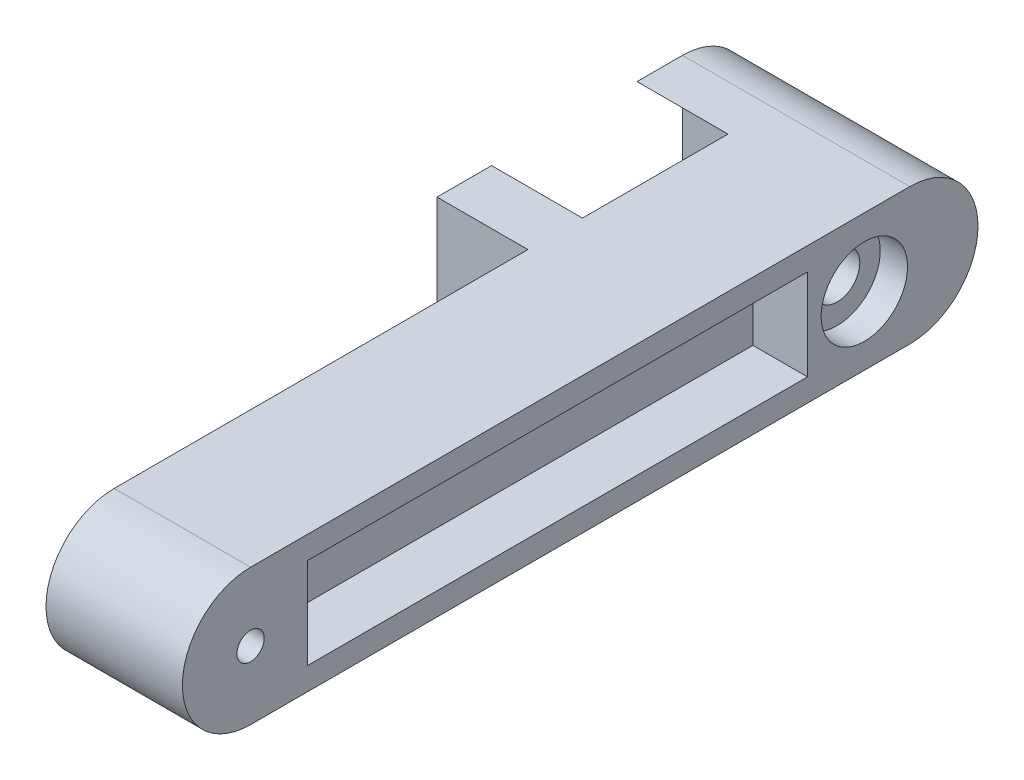
ISO-10303-21;
HEADER;
FILE_DESCRIPTION(('STEP AP214'),'2;1');
FILE_NAME('part.step','',(''),(''),'','','');
FILE_SCHEMA(('AUTOMOTIVE_DESIGN { 1 0 10303 214 1 1 1 1 }'));
ENDSEC;
DATA;
#1=APPLICATION_CONTEXT('core data for automotive mechanical design processes');
#2=APPLICATION_PROTOCOL_DEFINITION('international standard','automotive_design',2000,#1);
#3=PRODUCT_CONTEXT('',#1,'mechanical');
#4=PRODUCT('Part','Part','',(#3));
#5=PRODUCT_RELATED_PRODUCT_CATEGORY('part','',(#4));
#6=PRODUCT_DEFINITION_FORMATION('','',#4);
#7=PRODUCT_DEFINITION_CONTEXT('part definition',#1,'design');
#8=PRODUCT_DEFINITION('design','',#6,#7);
#9=PRODUCT_DEFINITION_SHAPE('','',#8);
#10=(LENGTH_UNIT() NAMED_UNIT(*) SI_UNIT(.MILLI.,.METRE.));
#11=(NAMED_UNIT(*) PLANE_ANGLE_UNIT() SI_UNIT($,.RADIAN.));
#12=(NAMED_UNIT(*) SI_UNIT($,.STERADIAN.) SOLID_ANGLE_UNIT());
#13=UNCERTAINTY_MEASURE_WITH_UNIT(LENGTH_MEASURE(1.E-05),#10,'distance_accuracy_value','');
#14=(GEOMETRIC_REPRESENTATION_CONTEXT(3) GLOBAL_UNCERTAINTY_ASSIGNED_CONTEXT((#13)) GLOBAL_UNIT_ASSIGNED_CONTEXT((#10,
#11,#12)) REPRESENTATION_CONTEXT('',''));
#15=CARTESIAN_POINT('',(0.,0.,0.));
#16=DIRECTION('',(0.,0.,1.));
#17=DIRECTION('',(1.,0.,0.));
#18=AXIS2_PLACEMENT_3D('',#15,#16,#17);
#19=CARTESIAN_POINT('',(0.,15.,0.));
#20=DIRECTION('',(-1.,0.,0.));
#21=DIRECTION('',(0.,0.,1.));
#22=AXIS2_PLACEMENT_3D('',#19,#20,#21);
#23=PLANE('',#22);
#24=CARTESIAN_POINT('',(0.,15.,-135.));
#25=DIRECTION('',(-1.,0.,0.));
#26=DIRECTION('',(0.,0.,1.));
#27=AXIS2_PLACEMENT_3D('',#24,#25,#26);
#28=CIRCLE('',#27,9.50000000000001);
#29=CARTESIAN_POINT('',(0.,15.,-125.5));
#30=VERTEX_POINT('',#29);
#31=EDGE_CURVE('E357',#30,#30,#28,.T.);
#32=ORIENTED_EDGE('',*,*,#31,.F.);
#33=EDGE_LOOP('',(#32));
#34=FACE_BOUND('',#33,.T.);
#35=CARTESIAN_POINT('',(0.,15.,-135.));
#36=DIRECTION('',(1.,0.,0.));
#37=DIRECTION('',(0.,0.,1.));
#38=AXIS2_PLACEMENT_3D('',#35,#36,#37);
#39=CIRCLE('',#38,15.);
#40=CARTESIAN_POINT('',(0.,26.1803398874989,-145.));
#41=VERTEX_POINT('',#40);
#42=CARTESIAN_POINT('',(0.,30.,-135.));
#43=VERTEX_POINT('',#42);
#44=EDGE_CURVE('E392',#41,#43,#39,.T.);
#45=ORIENTED_EDGE('',*,*,#44,.F.);
#46=DIRECTION('',(0.,-1.,0.));
#47=VECTOR('',#46,1.);
#48=CARTESIAN_POINT('',(0.,15.,-145.));
#49=LINE('',#48,#47);
#50=CARTESIAN_POINT('',(0.,3.81966011250106,-145.));
#51=VERTEX_POINT('',#50);
#52=EDGE_CURVE('E249',#41,#51,#49,.T.);
#53=ORIENTED_EDGE('',*,*,#52,.T.);
#54=CARTESIAN_POINT('',(0.,0.,-135.));
#55=VERTEX_POINT('',#54);
#56=EDGE_CURVE('E393',#55,#51,#39,.T.);
#57=ORIENTED_EDGE('',*,*,#56,.F.);
#58=DIRECTION('',(0.,0.,-1.));
#59=VECTOR('',#58,1.);
#60=CARTESIAN_POINT('',(0.,0.,-135.));
#61=LINE('',#60,#59);
#62=CARTESIAN_POINT('',(0.,0.,-103.));
#63=VERTEX_POINT('',#62);
#64=EDGE_CURVE('E389',#63,#55,#61,.T.);
#65=ORIENTED_EDGE('',*,*,#64,.F.);
#66=DIRECTION('',(0.,1.,0.));
#67=VECTOR('',#66,1.);
#68=CARTESIAN_POINT('',(0.,15.,-103.));
#69=LINE('',#68,#67);
#70=CARTESIAN_POINT('',(0.,5.,-103.));
#71=VERTEX_POINT('',#70);
#72=EDGE_CURVE('E280',#63,#71,#69,.T.);
#73=ORIENTED_EDGE('',*,*,#72,.T.);
#74=DIRECTION('',(0.,0.,1.));
#75=VECTOR('',#74,1.);
#76=CARTESIAN_POINT('',(0.,5.,-12.5));
#77=LINE('',#76,#75);
#78=CARTESIAN_POINT('',(0.,5.,-122.5));
#79=VERTEX_POINT('',#78);
#80=EDGE_CURVE('E304',#79,#71,#77,.T.);
#81=ORIENTED_EDGE('',*,*,#80,.F.);
#82=DIRECTION('',(0.,-1.,0.));
#83=VECTOR('',#82,1.);
#84=CARTESIAN_POINT('',(0.,5.,-122.5));
#85=LINE('',#84,#83);
#86=CARTESIAN_POINT('',(0.,25.,-122.5));
#87=VERTEX_POINT('',#86);
#88=EDGE_CURVE('E62',#87,#79,#85,.T.);
#89=ORIENTED_EDGE('',*,*,#88,.F.);
#90=DIRECTION('',(0.,0.,-1.));
#91=VECTOR('',#90,1.);
#92=CARTESIAN_POINT('',(0.,25.,-12.5));
#93=LINE('',#92,#91);
#94=CARTESIAN_POINT('',(0.,25.,-103.));
#95=VERTEX_POINT('',#94);
#96=EDGE_CURVE('E310',#95,#87,#93,.T.);
#97=ORIENTED_EDGE('',*,*,#96,.F.);
#98=CARTESIAN_POINT('',(0.,30.,-103.));
#99=VERTEX_POINT('',#98);
#100=EDGE_CURVE('E284',#95,#99,#69,.T.);
#101=ORIENTED_EDGE('',*,*,#100,.T.);
#102=DIRECTION('',(0.,0.,1.));
#103=VECTOR('',#102,1.);
#104=CARTESIAN_POINT('',(0.,30.,0.));
#105=LINE('',#104,#103);
#106=EDGE_CURVE('E382',#43,#99,#105,.T.);
#107=ORIENTED_EDGE('',*,*,#106,.F.);
#108=EDGE_LOOP('',(#45,#53,#57,#65,#73,#81,#89,#97,#101,#107));
#109=FACE_BOUND('',#108,.T.);
#110=ADVANCED_FACE('F39',(#34,#109),#23,.T.);
#111=CARTESIAN_POINT('',(0.,15.,0.));
#112=DIRECTION('',(1.,0.,0.));
#113=DIRECTION('',(0.,0.,-1.));
#114=AXIS2_PLACEMENT_3D('',#111,#112,#113);
#115=CIRCLE('',#114,3.);
#116=CARTESIAN_POINT('',(0.,15.,-3.));
#117=VERTEX_POINT('',#116);
#118=EDGE_CURVE('E372',#117,#117,#115,.T.);
#119=ORIENTED_EDGE('',*,*,#118,.T.);
#120=EDGE_LOOP('',(#119));
#121=FACE_BOUND('',#120,.T.);
#122=CARTESIAN_POINT('',(0.,30.,-91.));
#123=VERTEX_POINT('',#122);
#124=CARTESIAN_POINT('',(0.,30.,0.));
#125=VERTEX_POINT('',#124);
#126=EDGE_CURVE('E396',#123,#125,#105,.T.);
#127=ORIENTED_EDGE('',*,*,#126,.F.);
#128=DIRECTION('',(0.,-1.,0.));
#129=VECTOR('',#128,1.);
#130=CARTESIAN_POINT('',(0.,15.,-91.));
#131=LINE('',#130,#129);
#132=CARTESIAN_POINT('',(0.,25.,-91.));
#133=VERTEX_POINT('',#132);
#134=EDGE_CURVE('E276',#123,#133,#131,.T.);
#135=ORIENTED_EDGE('',*,*,#134,.T.);
#136=CARTESIAN_POINT('',(0.,25.,-12.5));
#137=VERTEX_POINT('',#136);
#138=EDGE_CURVE('E290',#137,#133,#93,.T.);
#139=ORIENTED_EDGE('',*,*,#138,.F.);
#140=DIRECTION('',(0.,1.,0.));
#141=VECTOR('',#140,1.);
#142=CARTESIAN_POINT('',(0.,5.,-12.5));
#143=LINE('',#142,#141);
#144=CARTESIAN_POINT('',(0.,5.,-12.5));
#145=VERTEX_POINT('',#144);
#146=EDGE_CURVE('E307',#145,#137,#143,.T.);
#147=ORIENTED_EDGE('',*,*,#146,.F.);
#148=CARTESIAN_POINT('',(0.,5.,-91.));
#149=VERTEX_POINT('',#148);
#150=EDGE_CURVE('E303',#149,#145,#77,.T.);
#151=ORIENTED_EDGE('',*,*,#150,.F.);
#152=CARTESIAN_POINT('',(0.,0.,-91.));
#153=VERTEX_POINT('',#152);
#154=EDGE_CURVE('E272',#149,#153,#131,.T.);
#155=ORIENTED_EDGE('',*,*,#154,.T.);
#156=CARTESIAN_POINT('',(0.,0.,0.));
#157=VERTEX_POINT('',#156);
#158=EDGE_CURVE('E390',#157,#153,#61,.T.);
#159=ORIENTED_EDGE('',*,*,#158,.F.);
#160=CARTESIAN_POINT('',(0.,15.,0.));
#161=DIRECTION('',(1.,0.,0.));
#162=DIRECTION('',(0.,0.,1.));
#163=AXIS2_PLACEMENT_3D('',#160,#161,#162);
#164=CIRCLE('',#163,15.);
#165=EDGE_CURVE('E375',#125,#157,#164,.T.);
#166=ORIENTED_EDGE('',*,*,#165,.F.);
#167=EDGE_LOOP('',(#127,#135,#139,#147,#151,#155,#159,#166));
#168=FACE_BOUND('',#167,.T.);
#169=ADVANCED_FACE('F424',(#121,#168),#23,.T.);
#170=CARTESIAN_POINT('',(12.,25.,-12.5));
#171=DIRECTION('',(0.,1.,0.));
#172=DIRECTION('',(0.,0.,1.));
#173=AXIS2_PLACEMENT_3D('',#170,#171,#172);
#174=PLANE('',#173);
#175=DIRECTION('',(1.,0.,0.));
#176=VECTOR('',#175,1.);
#177=CARTESIAN_POINT('',(12.,25.,-103.));
#178=LINE('',#177,#176);
#179=CARTESIAN_POINT('',(12.,25.,-103.));
#180=VERTEX_POINT('',#179);
#181=EDGE_CURVE('E283',#95,#180,#178,.T.);
#182=ORIENTED_EDGE('',*,*,#181,.F.);
#183=ORIENTED_EDGE('',*,*,#96,.T.);
#184=DIRECTION('',(-1.,0.,0.));
#185=VECTOR('',#184,1.);
#186=CARTESIAN_POINT('',(12.,25.,-122.5));
#187=LINE('',#186,#185);
#188=CARTESIAN_POINT('',(12.,25.,-122.5));
#189=VERTEX_POINT('',#188);
#190=EDGE_CURVE('E313',#189,#87,#187,.T.);
#191=ORIENTED_EDGE('',*,*,#190,.F.);
#192=DIRECTION('',(0.,0.,-1.));
#193=VECTOR('',#192,1.);
#194=CARTESIAN_POINT('',(12.,25.,-12.5));
#195=LINE('',#194,#193);
#196=EDGE_CURVE('E297',#180,#189,#195,.T.);
#197=ORIENTED_EDGE('',*,*,#196,.F.);
#198=EDGE_LOOP('',(#182,#183,#191,#197));
#199=FACE_BOUND('',#198,.T.);
#200=ADVANCED_FACE('F470',(#199),#174,.F.);
#201=DIRECTION('',(-1.,0.,0.));
#202=VECTOR('',#201,1.);
#203=CARTESIAN_POINT('',(12.,25.,-91.));
#204=LINE('',#203,#202);
#205=CARTESIAN_POINT('',(12.,25.,-91.));
#206=VERTEX_POINT('',#205);
#207=EDGE_CURVE('E275',#206,#133,#204,.T.);
#208=ORIENTED_EDGE('',*,*,#207,.F.);
#209=CARTESIAN_POINT('',(12.,25.,-12.5));
#210=VERTEX_POINT('',#209);
#211=EDGE_CURVE('E298',#210,#206,#195,.T.);
#212=ORIENTED_EDGE('',*,*,#211,.F.);
#213=DIRECTION('',(-1.,0.,0.));
#214=VECTOR('',#213,1.);
#215=CARTESIAN_POINT('',(12.,25.,-12.5));
#216=LINE('',#215,#214);
#217=EDGE_CURVE('E316',#210,#137,#216,.T.);
#218=ORIENTED_EDGE('',*,*,#217,.T.);
#219=ORIENTED_EDGE('',*,*,#138,.T.);
#220=EDGE_LOOP('',(#208,#212,#218,#219));
#221=FACE_BOUND('',#220,.T.);
#222=ADVANCED_FACE('F417',(#221),#174,.F.);
#223=CARTESIAN_POINT('',(12.,5.,-12.5));
#224=DIRECTION('',(0.,-1.,0.));
#225=DIRECTION('',(0.,0.,-1.));
#226=AXIS2_PLACEMENT_3D('',#223,#224,#225);
#227=PLANE('',#226);
#228=DIRECTION('',(-1.,0.,0.));
#229=VECTOR('',#228,1.);
#230=CARTESIAN_POINT('',(12.,5.,-103.));
#231=LINE('',#230,#229);
#232=CARTESIAN_POINT('',(12.,5.,-103.));
#233=VERTEX_POINT('',#232);
#234=EDGE_CURVE('E278',#233,#71,#231,.T.);
#235=ORIENTED_EDGE('',*,*,#234,.F.);
#236=DIRECTION('',(0.,0.,1.));
#237=VECTOR('',#236,1.);
#238=CARTESIAN_POINT('',(12.,5.,-12.5));
#239=LINE('',#238,#237);
#240=CARTESIAN_POINT('',(12.,5.,-122.5));
#241=VERTEX_POINT('',#240);
#242=EDGE_CURVE('E291',#241,#233,#239,.T.);
#243=ORIENTED_EDGE('',*,*,#242,.F.);
#244=DIRECTION('',(-1.,0.,0.));
#245=VECTOR('',#244,1.);
#246=CARTESIAN_POINT('',(12.,5.,-122.5));
#247=LINE('',#246,#245);
#248=EDGE_CURVE('E301',#241,#79,#247,.T.);
#249=ORIENTED_EDGE('',*,*,#248,.T.);
#250=ORIENTED_EDGE('',*,*,#80,.T.);
#251=EDGE_LOOP('',(#235,#243,#249,#250));
#252=FACE_BOUND('',#251,.T.);
#253=ADVANCED_FACE('F460',(#252),#227,.F.);
#254=DIRECTION('',(1.,0.,0.));
#255=VECTOR('',#254,1.);
#256=CARTESIAN_POINT('',(12.,5.,-91.));
#257=LINE('',#256,#255);
#258=CARTESIAN_POINT('',(12.,5.,-91.));
#259=VERTEX_POINT('',#258);
#260=EDGE_CURVE('E54',#149,#259,#257,.T.);
#261=ORIENTED_EDGE('',*,*,#260,.F.);
#262=ORIENTED_EDGE('',*,*,#150,.T.);
#263=DIRECTION('',(-1.,0.,0.));
#264=VECTOR('',#263,1.);
#265=CARTESIAN_POINT('',(12.,5.,-12.5));
#266=LINE('',#265,#264);
#267=CARTESIAN_POINT('',(12.,5.,-12.5));
#268=VERTEX_POINT('',#267);
#269=EDGE_CURVE('E318',#268,#145,#266,.T.);
#270=ORIENTED_EDGE('',*,*,#269,.F.);
#271=EDGE_CURVE('E289',#259,#268,#239,.T.);
#272=ORIENTED_EDGE('',*,*,#271,.F.);
#273=EDGE_LOOP('',(#261,#262,#270,#272));
#274=FACE_BOUND('',#273,.T.);
#275=ADVANCED_FACE('F410',(#274),#227,.F.);
#276=CARTESIAN_POINT('',(12.,0.,0.));
#277=DIRECTION('',(-1.,0.,0.));
#278=DIRECTION('',(0.,0.,1.));
#279=AXIS2_PLACEMENT_3D('',#276,#277,#278);
#280=PLANE('',#279);
#281=ORIENTED_EDGE('',*,*,#242,.T.);
#282=DIRECTION('',(0.,1.,0.));
#283=VECTOR('',#282,1.);
#284=CARTESIAN_POINT('',(12.,0.,-103.));
#285=LINE('',#284,#283);
#286=EDGE_CURVE('E11',#233,#180,#285,.T.);
#287=ORIENTED_EDGE('',*,*,#286,.T.);
#288=ORIENTED_EDGE('',*,*,#196,.T.);
#289=DIRECTION('',(0.,-1.,0.));
#290=VECTOR('',#289,1.);
#291=CARTESIAN_POINT('',(12.,5.,-122.5));
#292=LINE('',#291,#290);
#293=EDGE_CURVE('E286',#189,#241,#292,.T.);
#294=ORIENTED_EDGE('',*,*,#293,.T.);
#295=EDGE_LOOP('',(#281,#287,#288,#294));
#296=FACE_BOUND('',#295,.T.);
#297=ADVANCED_FACE('F462',(#296),#280,.T.);
#298=ORIENTED_EDGE('',*,*,#211,.T.);
#299=DIRECTION('',(0.,-1.,0.));
#300=VECTOR('',#299,1.);
#301=CARTESIAN_POINT('',(12.,0.,-91.));
#302=LINE('',#301,#300);
#303=EDGE_CURVE('E47',#206,#259,#302,.T.);
#304=ORIENTED_EDGE('',*,*,#303,.T.);
#305=ORIENTED_EDGE('',*,*,#271,.T.);
#306=DIRECTION('',(0.,1.,0.));
#307=VECTOR('',#306,1.);
#308=CARTESIAN_POINT('',(12.,5.,-12.5));
#309=LINE('',#308,#307);
#310=EDGE_CURVE('E294',#268,#210,#309,.T.);
#311=ORIENTED_EDGE('',*,*,#310,.T.);
#312=EDGE_LOOP('',(#298,#304,#305,#311));
#313=FACE_BOUND('',#312,.T.);
#314=ADVANCED_FACE('F405',(#313),#280,.T.);
#315=CARTESIAN_POINT('',(30.,15.,0.));
#316=DIRECTION('',(-1.,0.,0.));
#317=DIRECTION('',(0.,0.,1.));
#318=AXIS2_PLACEMENT_3D('',#315,#316,#317);
#319=CYLINDRICAL_SURFACE('',#318,15.);
#320=ORIENTED_EDGE('',*,*,#165,.T.);
#321=DIRECTION('',(-1.,0.,0.));
#322=VECTOR('',#321,1.);
#323=CARTESIAN_POINT('',(30.,0.,0.));
#324=LINE('',#323,#322);
#325=CARTESIAN_POINT('',(30.,0.,0.));
#326=VERTEX_POINT('',#325);
#327=EDGE_CURVE('E401',#326,#157,#324,.T.);
#328=ORIENTED_EDGE('',*,*,#327,.F.);
#329=CARTESIAN_POINT('',(30.,15.,0.));
#330=DIRECTION('',(1.,0.,0.));
#331=DIRECTION('',(0.,0.,1.));
#332=AXIS2_PLACEMENT_3D('',#329,#330,#331);
#333=CIRCLE('',#332,15.);
#334=CARTESIAN_POINT('',(30.,30.,0.));
#335=VERTEX_POINT('',#334);
#336=EDGE_CURVE('E378',#335,#326,#333,.T.);
#337=ORIENTED_EDGE('',*,*,#336,.F.);
#338=DIRECTION('',(-1.,0.,0.));
#339=VECTOR('',#338,1.);
#340=CARTESIAN_POINT('',(30.,30.,0.));
#341=LINE('',#340,#339);
#342=EDGE_CURVE('E386',#335,#125,#341,.T.);
#343=ORIENTED_EDGE('',*,*,#342,.T.);
#344=EDGE_LOOP('',(#320,#328,#337,#343));
#345=FACE_BOUND('',#344,.T.);
#346=ADVANCED_FACE('F41',(#345),#319,.T.);
#347=CARTESIAN_POINT('',(30.,0.,-135.));
#348=DIRECTION('',(0.,1.,0.));
#349=DIRECTION('',(0.,0.,1.));
#350=AXIS2_PLACEMENT_3D('',#347,#348,#349);
#351=PLANE('',#350);
#352=ORIENTED_EDGE('',*,*,#158,.T.);
#353=DIRECTION('',(1.,0.,0.));
#354=VECTOR('',#353,1.);
#355=CARTESIAN_POINT('',(-20.,0.,-91.));
#356=LINE('',#355,#354);
#357=CARTESIAN_POINT('',(-20.,0.,-91.));
#358=VERTEX_POINT('',#357);
#359=EDGE_CURVE('E266',#358,#153,#356,.T.);
#360=ORIENTED_EDGE('',*,*,#359,.F.);
#361=DIRECTION('',(0.,0.,1.));
#362=VECTOR('',#361,1.);
#363=CARTESIAN_POINT('',(-20.,0.,-103.));
#364=LINE('',#363,#362);
#365=CARTESIAN_POINT('',(-20.,0.,-103.));
#366=VERTEX_POINT('',#365);
#367=EDGE_CURVE('E255',#366,#358,#364,.T.);
#368=ORIENTED_EDGE('',*,*,#367,.F.);
#369=DIRECTION('',(1.,0.,0.));
#370=VECTOR('',#369,1.);
#371=CARTESIAN_POINT('',(-20.,0.,-103.));
#372=LINE('',#371,#370);
#373=EDGE_CURVE('E268',#366,#63,#372,.T.);
#374=ORIENTED_EDGE('',*,*,#373,.T.);
#375=ORIENTED_EDGE('',*,*,#64,.T.);
#376=DIRECTION('',(1.,0.,0.));
#377=VECTOR('',#376,1.);
#378=CARTESIAN_POINT('',(-59.0512483795333,0.,-135.));
#379=LINE('',#378,#377);
#380=CARTESIAN_POINT('',(-20.,0.,-135.));
#381=VERTEX_POINT('',#380);
#382=EDGE_CURVE('E226',#381,#55,#379,.T.);
#383=ORIENTED_EDGE('',*,*,#382,.F.);
#384=DIRECTION('',(0.,0.,-1.));
#385=VECTOR('',#384,1.);
#386=CARTESIAN_POINT('',(-20.,0.,-145.));
#387=LINE('',#386,#385);
#388=CARTESIAN_POINT('',(-20.,0.,-145.));
#389=VERTEX_POINT('',#388);
#390=EDGE_CURVE('E206',#381,#389,#387,.T.);
#391=ORIENTED_EDGE('',*,*,#390,.T.);
#392=DIRECTION('',(1.,0.,0.));
#393=VECTOR('',#392,1.);
#394=CARTESIAN_POINT('',(-59.0512483795333,0.,-145.));
#395=LINE('',#394,#393);
#396=CARTESIAN_POINT('',(30.,0.,-145.));
#397=VERTEX_POINT('',#396);
#398=EDGE_CURVE('E214',#389,#397,#395,.T.);
#399=ORIENTED_EDGE('',*,*,#398,.T.);
#400=DIRECTION('',(0.,0.,-1.));
#401=VECTOR('',#400,1.);
#402=CARTESIAN_POINT('',(30.,0.,-135.));
#403=LINE('',#402,#401);
#404=EDGE_CURVE('E381',#326,#397,#403,.T.);
#405=ORIENTED_EDGE('',*,*,#404,.F.);
#406=ORIENTED_EDGE('',*,*,#327,.T.);
#407=EDGE_LOOP('',(#352,#360,#368,#374,#375,#383,#391,#399,#405,#406));
#408=FACE_BOUND('',#407,.T.);
#409=ADVANCED_FACE('F224',(#408),#351,.F.);
#410=CARTESIAN_POINT('',(30.,30.,0.));
#411=DIRECTION('',(0.,-1.,0.));
#412=DIRECTION('',(0.,0.,-1.));
#413=AXIS2_PLACEMENT_3D('',#410,#411,#412);
#414=PLANE('',#413);
#415=ORIENTED_EDGE('',*,*,#106,.T.);
#416=DIRECTION('',(1.,0.,0.));
#417=VECTOR('',#416,1.);
#418=CARTESIAN_POINT('',(-20.,30.,-103.));
#419=LINE('',#418,#417);
#420=CARTESIAN_POINT('',(-20.,30.,-103.));
#421=VERTEX_POINT('',#420);
#422=EDGE_CURVE('E261',#421,#99,#419,.T.);
#423=ORIENTED_EDGE('',*,*,#422,.F.);
#424=DIRECTION('',(0.,0.,-1.));
#425=VECTOR('',#424,1.);
#426=CARTESIAN_POINT('',(-20.,30.,-103.));
#427=LINE('',#426,#425);
#428=CARTESIAN_POINT('',(-20.,30.,-91.));
#429=VERTEX_POINT('',#428);
#430=EDGE_CURVE('E259',#429,#421,#427,.T.);
#431=ORIENTED_EDGE('',*,*,#430,.F.);
#432=DIRECTION('',(1.,0.,0.));
#433=VECTOR('',#432,1.);
#434=CARTESIAN_POINT('',(-20.,30.,-91.));
#435=LINE('',#434,#433);
#436=EDGE_CURVE('E263',#429,#123,#435,.T.);
#437=ORIENTED_EDGE('',*,*,#436,.T.);
#438=ORIENTED_EDGE('',*,*,#126,.T.);
#439=ORIENTED_EDGE('',*,*,#342,.F.);
#440=DIRECTION('',(0.,0.,1.));
#441=VECTOR('',#440,1.);
#442=CARTESIAN_POINT('',(30.,30.,0.));
#443=LINE('',#442,#441);
#444=CARTESIAN_POINT('',(30.,30.,-145.));
#445=VERTEX_POINT('',#444);
#446=EDGE_CURVE('E384',#445,#335,#443,.T.);
#447=ORIENTED_EDGE('',*,*,#446,.F.);
#448=DIRECTION('',(1.,0.,0.));
#449=VECTOR('',#448,1.);
#450=CARTESIAN_POINT('',(-59.0512483795333,30.,-145.));
#451=LINE('',#450,#449);
#452=CARTESIAN_POINT('',(-20.,30.,-145.));
#453=VERTEX_POINT('',#452);
#454=EDGE_CURVE('E213',#453,#445,#451,.T.);
#455=ORIENTED_EDGE('',*,*,#454,.F.);
#456=DIRECTION('',(0.,0.,1.));
#457=VECTOR('',#456,1.);
#458=CARTESIAN_POINT('',(-20.,30.,-135.));
#459=LINE('',#458,#457);
#460=CARTESIAN_POINT('',(-20.,30.,-135.));
#461=VERTEX_POINT('',#460);
#462=EDGE_CURVE('E209',#453,#461,#459,.T.);
#463=ORIENTED_EDGE('',*,*,#462,.T.);
#464=DIRECTION('',(1.,0.,0.));
#465=VECTOR('',#464,1.);
#466=CARTESIAN_POINT('',(-59.0512483795333,30.,-135.));
#467=LINE('',#466,#465);
#468=EDGE_CURVE('E236',#461,#43,#467,.T.);
#469=ORIENTED_EDGE('',*,*,#468,.T.);
#470=EDGE_LOOP('',(#415,#423,#431,#437,#438,#439,#447,#455,#463,#469));
#471=FACE_BOUND('',#470,.T.);
#472=ADVANCED_FACE('F428',(#471),#414,.F.);
#473=CARTESIAN_POINT('',(30.,15.,0.));
#474=DIRECTION('',(-1.,0.,0.));
#475=DIRECTION('',(0.,0.,1.));
#476=AXIS2_PLACEMENT_3D('',#473,#474,#475);
#477=PLANE('',#476);
#478=DIRECTION('',(0.,0.,1.));
#479=VECTOR('',#478,1.);
#480=CARTESIAN_POINT('',(30.,25.,-12.5));
#481=LINE('',#480,#479);
#482=CARTESIAN_POINT('',(30.,25.,-122.5));
#483=VERTEX_POINT('',#482);
#484=CARTESIAN_POINT('',(30.,25.,-12.5));
#485=VERTEX_POINT('',#484);
#486=EDGE_CURVE('E337',#483,#485,#481,.T.);
#487=ORIENTED_EDGE('',*,*,#486,.F.);
#488=DIRECTION('',(0.,1.,0.));
#489=VECTOR('',#488,1.);
#490=CARTESIAN_POINT('',(30.,25.,-122.5));
#491=LINE('',#490,#489);
#492=CARTESIAN_POINT('',(30.,5.,-122.5));
#493=VERTEX_POINT('',#492);
#494=EDGE_CURVE('E315',#493,#483,#491,.T.);
#495=ORIENTED_EDGE('',*,*,#494,.F.);
#496=DIRECTION('',(0.,0.,-1.));
#497=VECTOR('',#496,1.);
#498=CARTESIAN_POINT('',(30.,5.,-12.5));
#499=LINE('',#498,#497);
#500=CARTESIAN_POINT('',(30.,5.,-12.5));
#501=VERTEX_POINT('',#500);
#502=EDGE_CURVE('E326',#501,#493,#499,.T.);
#503=ORIENTED_EDGE('',*,*,#502,.F.);
#504=DIRECTION('',(0.,-1.,0.));
#505=VECTOR('',#504,1.);
#506=CARTESIAN_POINT('',(30.,25.,-12.5));
#507=LINE('',#506,#505);
#508=EDGE_CURVE('E340',#485,#501,#507,.T.);
#509=ORIENTED_EDGE('',*,*,#508,.F.);
#510=EDGE_LOOP('',(#487,#495,#503,#509));
#511=FACE_BOUND('',#510,.T.);
#512=CARTESIAN_POINT('',(30.,15.,-135.));
#513=DIRECTION('',(1.,0.,0.));
#514=DIRECTION('',(0.,0.,-1.));
#515=AXIS2_PLACEMENT_3D('',#512,#513,#514);
#516=CIRCLE('',#515,9.50000000000001);
#517=CARTESIAN_POINT('',(30.,15.,-144.5));
#518=VERTEX_POINT('',#517);
#519=EDGE_CURVE('E363',#518,#518,#516,.T.);
#520=ORIENTED_EDGE('',*,*,#519,.F.);
#521=EDGE_LOOP('',(#520));
#522=FACE_BOUND('',#521,.T.);
#523=CARTESIAN_POINT('',(30.,15.,0.));
#524=DIRECTION('',(1.,0.,0.));
#525=DIRECTION('',(0.,0.,-1.));
#526=AXIS2_PLACEMENT_3D('',#523,#524,#525);
#527=CIRCLE('',#526,3.);
#528=CARTESIAN_POINT('',(30.,15.,-3.));
#529=VERTEX_POINT('',#528);
#530=EDGE_CURVE('E369',#529,#529,#527,.T.);
#531=ORIENTED_EDGE('',*,*,#530,.F.);
#532=EDGE_LOOP('',(#531));
#533=FACE_BOUND('',#532,.T.);
#534=ORIENTED_EDGE('',*,*,#336,.T.);
#535=ORIENTED_EDGE('',*,*,#404,.T.);
#536=CARTESIAN_POINT('',(30.,15.,-145.));
#537=DIRECTION('',(1.,0.,0.));
#538=DIRECTION('',(0.,0.,1.));
#539=AXIS2_PLACEMENT_3D('',#536,#537,#538);
#540=CIRCLE('',#539,15.);
#541=EDGE_CURVE('E220',#397,#445,#540,.T.);
#542=ORIENTED_EDGE('',*,*,#541,.T.);
#543=ORIENTED_EDGE('',*,*,#446,.T.);
#544=EDGE_LOOP('',(#534,#535,#542,#543));
#545=FACE_BOUND('',#544,.T.);
#546=ADVANCED_FACE('F434',(#511,#522,#533,#545),#477,.F.);
#547=CARTESIAN_POINT('',(0.,15.,0.));
#548=DIRECTION('',(1.,0.,0.));
#549=DIRECTION('',(0.,0.,-1.));
#550=AXIS2_PLACEMENT_3D('',#547,#548,#549);
#551=CYLINDRICAL_SURFACE('',#550,3.);
#552=ORIENTED_EDGE('',*,*,#118,.F.);
#553=EDGE_LOOP('',(#552));
#554=FACE_BOUND('',#553,.T.);
#555=ORIENTED_EDGE('',*,*,#530,.T.);
#556=EDGE_LOOP('',(#555));
#557=FACE_BOUND('',#556,.T.);
#558=ADVANCED_FACE('F558',(#554,#557),#551,.F.);
#559=CARTESIAN_POINT('',(24.,15.,-135.));
#560=DIRECTION('',(1.,0.,0.));
#561=DIRECTION('',(0.,0.,-1.));
#562=AXIS2_PLACEMENT_3D('',#559,#560,#561);
#563=CYLINDRICAL_SURFACE('',#562,9.50000000000001);
#564=CARTESIAN_POINT('',(24.,15.,-135.));
#565=DIRECTION('',(1.,0.,0.));
#566=DIRECTION('',(0.,0.,-1.));
#567=AXIS2_PLACEMENT_3D('',#564,#565,#566);
#568=CIRCLE('',#567,9.50000000000001);
#569=CARTESIAN_POINT('',(24.,15.,-144.5));
#570=VERTEX_POINT('',#569);
#571=EDGE_CURVE('E366',#570,#570,#568,.T.);
#572=ORIENTED_EDGE('',*,*,#571,.F.);
#573=EDGE_LOOP('',(#572));
#574=FACE_BOUND('',#573,.T.);
#575=ORIENTED_EDGE('',*,*,#519,.T.);
#576=EDGE_LOOP('',(#575));
#577=FACE_BOUND('',#576,.T.);
#578=ADVANCED_FACE('F555',(#574,#577),#563,.F.);
#579=CARTESIAN_POINT('',(24.,15.,-135.));
#580=DIRECTION('',(1.,0.,0.));
#581=DIRECTION('',(0.,0.,-1.));
#582=AXIS2_PLACEMENT_3D('',#579,#580,#581);
#583=PLANE('',#582);
#584=CARTESIAN_POINT('',(24.,15.,-135.));
#585=DIRECTION('',(1.,0.,0.));
#586=DIRECTION('',(0.,0.,-1.));
#587=AXIS2_PLACEMENT_3D('',#584,#585,#586);
#588=CIRCLE('',#587,4.99999999999999);
#589=CARTESIAN_POINT('',(24.,15.,-140.));
#590=VERTEX_POINT('',#589);
#591=EDGE_CURVE('E347',#590,#590,#588,.F.);
#592=ORIENTED_EDGE('',*,*,#591,.T.);
#593=EDGE_LOOP('',(#592));
#594=FACE_BOUND('',#593,.T.);
#595=ORIENTED_EDGE('',*,*,#571,.T.);
#596=EDGE_LOOP('',(#595));
#597=FACE_BOUND('',#596,.T.);
#598=ADVANCED_FACE('F551',(#594,#597),#583,.T.);
#599=CARTESIAN_POINT('',(6.,15.,-135.));
#600=DIRECTION('',(-1.,0.,0.));
#601=DIRECTION('',(0.,0.,1.));
#602=AXIS2_PLACEMENT_3D('',#599,#600,#601);
#603=CYLINDRICAL_SURFACE('',#602,9.50000000000001);
#604=CARTESIAN_POINT('',(6.,15.,-135.));
#605=DIRECTION('',(-1.,0.,0.));
#606=DIRECTION('',(0.,0.,1.));
#607=AXIS2_PLACEMENT_3D('',#604,#605,#606);
#608=CIRCLE('',#607,9.50000000000001);
#609=CARTESIAN_POINT('',(6.,15.,-125.5));
#610=VERTEX_POINT('',#609);
#611=EDGE_CURVE('E360',#610,#610,#608,.T.);
#612=ORIENTED_EDGE('',*,*,#611,.F.);
#613=EDGE_LOOP('',(#612));
#614=FACE_BOUND('',#613,.T.);
#615=ORIENTED_EDGE('',*,*,#31,.T.);
#616=EDGE_LOOP('',(#615));
#617=FACE_BOUND('',#616,.T.);
#618=ADVANCED_FACE('F547',(#614,#617),#603,.F.);
#619=CARTESIAN_POINT('',(6.,15.,-135.));
#620=DIRECTION('',(-1.,0.,0.));
#621=DIRECTION('',(0.,0.,1.));
#622=AXIS2_PLACEMENT_3D('',#619,#620,#621);
#623=PLANE('',#622);
#624=CARTESIAN_POINT('',(6.,15.,-135.));
#625=DIRECTION('',(-1.,0.,0.));
#626=DIRECTION('',(0.,0.,1.));
#627=AXIS2_PLACEMENT_3D('',#624,#625,#626);
#628=CIRCLE('',#627,4.99999999999999);
#629=CARTESIAN_POINT('',(6.,15.,-130.));
#630=VERTEX_POINT('',#629);
#631=EDGE_CURVE('E354',#630,#630,#628,.T.);
#632=ORIENTED_EDGE('',*,*,#631,.F.);
#633=EDGE_LOOP('',(#632));
#634=FACE_BOUND('',#633,.T.);
#635=ORIENTED_EDGE('',*,*,#611,.T.);
#636=EDGE_LOOP('',(#635));
#637=FACE_BOUND('',#636,.T.);
#638=ADVANCED_FACE('F543',(#634,#637),#623,.T.);
#639=CARTESIAN_POINT('',(30.001,15.,-135.));
#640=DIRECTION('',(-1.,0.,0.));
#641=DIRECTION('',(0.,0.,1.));
#642=AXIS2_PLACEMENT_3D('',#639,#640,#641);
#643=CYLINDRICAL_SURFACE('',#642,4.99999999999999);
#644=ORIENTED_EDGE('',*,*,#591,.F.);
#645=EDGE_LOOP('',(#644));
#646=FACE_BOUND('',#645,.T.);
#647=ORIENTED_EDGE('',*,*,#631,.T.);
#648=EDGE_LOOP('',(#647));
#649=FACE_BOUND('',#648,.T.);
#650=ADVANCED_FACE('F539',(#646,#649),#643,.F.);
#651=CARTESIAN_POINT('',(18.,25.,-122.5));
#652=DIRECTION('',(0.,0.,-1.));
#653=DIRECTION('',(-1.,0.,0.));
#654=AXIS2_PLACEMENT_3D('',#651,#652,#653);
#655=PLANE('',#654);
#656=ORIENTED_EDGE('',*,*,#494,.T.);
#657=DIRECTION('',(1.,0.,0.));
#658=VECTOR('',#657,1.);
#659=CARTESIAN_POINT('',(18.,25.,-122.5));
#660=LINE('',#659,#658);
#661=CARTESIAN_POINT('',(18.,25.,-122.5));
#662=VERTEX_POINT('',#661);
#663=EDGE_CURVE('E335',#662,#483,#660,.T.);
#664=ORIENTED_EDGE('',*,*,#663,.F.);
#665=DIRECTION('',(0.,1.,0.));
#666=VECTOR('',#665,1.);
#667=CARTESIAN_POINT('',(18.,25.,-122.5));
#668=LINE('',#667,#666);
#669=CARTESIAN_POINT('',(18.,5.,-122.5));
#670=VERTEX_POINT('',#669);
#671=EDGE_CURVE('E322',#670,#662,#668,.T.);
#672=ORIENTED_EDGE('',*,*,#671,.F.);
#673=DIRECTION('',(1.,0.,0.));
#674=VECTOR('',#673,1.);
#675=CARTESIAN_POINT('',(18.,5.,-122.5));
#676=LINE('',#675,#674);
#677=EDGE_CURVE('E345',#670,#493,#676,.T.);
#678=ORIENTED_EDGE('',*,*,#677,.T.);
#679=EDGE_LOOP('',(#656,#664,#672,#678));
#680=FACE_BOUND('',#679,.T.);
#681=ADVANCED_FACE('F529',(#680),#655,.F.);
#682=CARTESIAN_POINT('',(18.,5.,-12.5));
#683=DIRECTION('',(0.,-1.,0.));
#684=DIRECTION('',(0.,0.,-1.));
#685=AXIS2_PLACEMENT_3D('',#682,#683,#684);
#686=PLANE('',#685);
#687=ORIENTED_EDGE('',*,*,#502,.T.);
#688=ORIENTED_EDGE('',*,*,#677,.F.);
#689=DIRECTION('',(0.,0.,-1.));
#690=VECTOR('',#689,1.);
#691=CARTESIAN_POINT('',(18.,5.,-12.5));
#692=LINE('',#691,#690);
#693=CARTESIAN_POINT('',(18.,5.,-12.5));
#694=VERTEX_POINT('',#693);
#695=EDGE_CURVE('E332',#694,#670,#692,.T.);
#696=ORIENTED_EDGE('',*,*,#695,.F.);
#697=DIRECTION('',(1.,0.,0.));
#698=VECTOR('',#697,1.);
#699=CARTESIAN_POINT('',(18.,5.,-12.5));
#700=LINE('',#699,#698);
#701=EDGE_CURVE('E348',#694,#501,#700,.T.);
#702=ORIENTED_EDGE('',*,*,#701,.T.);
#703=EDGE_LOOP('',(#687,#688,#696,#702));
#704=FACE_BOUND('',#703,.T.);
#705=ADVANCED_FACE('F525',(#704),#686,.F.);
#706=CARTESIAN_POINT('',(18.,25.,-12.5));
#707=DIRECTION('',(0.,0.,1.));
#708=DIRECTION('',(1.,0.,0.));
#709=AXIS2_PLACEMENT_3D('',#706,#707,#708);
#710=PLANE('',#709);
#711=ORIENTED_EDGE('',*,*,#508,.T.);
#712=ORIENTED_EDGE('',*,*,#701,.F.);
#713=DIRECTION('',(0.,-1.,0.));
#714=VECTOR('',#713,1.);
#715=CARTESIAN_POINT('',(18.,25.,-12.5));
#716=LINE('',#715,#714);
#717=CARTESIAN_POINT('',(18.,25.,-12.5));
#718=VERTEX_POINT('',#717);
#719=EDGE_CURVE('E329',#718,#694,#716,.T.);
#720=ORIENTED_EDGE('',*,*,#719,.F.);
#721=DIRECTION('',(1.,0.,0.));
#722=VECTOR('',#721,1.);
#723=CARTESIAN_POINT('',(18.,25.,-12.5));
#724=LINE('',#723,#722);
#725=EDGE_CURVE('E350',#718,#485,#724,.T.);
#726=ORIENTED_EDGE('',*,*,#725,.T.);
#727=EDGE_LOOP('',(#711,#712,#720,#726));
#728=FACE_BOUND('',#727,.T.);
#729=ADVANCED_FACE('F528',(#728),#710,.F.);
#730=CARTESIAN_POINT('',(18.,25.,-12.5));
#731=DIRECTION('',(0.,1.,0.));
#732=DIRECTION('',(0.,0.,1.));
#733=AXIS2_PLACEMENT_3D('',#730,#731,#732);
#734=PLANE('',#733);
#735=ORIENTED_EDGE('',*,*,#486,.T.);
#736=ORIENTED_EDGE('',*,*,#725,.F.);
#737=DIRECTION('',(0.,0.,1.));
#738=VECTOR('',#737,1.);
#739=CARTESIAN_POINT('',(18.,25.,-12.5));
#740=LINE('',#739,#738);
#741=EDGE_CURVE('E325',#662,#718,#740,.T.);
#742=ORIENTED_EDGE('',*,*,#741,.F.);
#743=ORIENTED_EDGE('',*,*,#663,.T.);
#744=EDGE_LOOP('',(#735,#736,#742,#743));
#745=FACE_BOUND('',#744,.T.);
#746=ADVANCED_FACE('F523',(#745),#734,.F.);
#747=CARTESIAN_POINT('',(18.,0.,0.));
#748=DIRECTION('',(1.,0.,0.));
#749=DIRECTION('',(0.,0.,-1.));
#750=AXIS2_PLACEMENT_3D('',#747,#748,#749);
#751=PLANE('',#750);
#752=ORIENTED_EDGE('',*,*,#671,.T.);
#753=ORIENTED_EDGE('',*,*,#741,.T.);
#754=ORIENTED_EDGE('',*,*,#719,.T.);
#755=ORIENTED_EDGE('',*,*,#695,.T.);
#756=EDGE_LOOP('',(#752,#753,#754,#755));
#757=FACE_BOUND('',#756,.T.);
#758=ADVANCED_FACE('F520',(#757),#751,.T.);
#759=CARTESIAN_POINT('',(12.,5.,-122.5));
#760=DIRECTION('',(0.,0.,-1.));
#761=DIRECTION('',(-1.,0.,0.));
#762=AXIS2_PLACEMENT_3D('',#759,#760,#761);
#763=PLANE('',#762);
#764=ORIENTED_EDGE('',*,*,#88,.T.);
#765=ORIENTED_EDGE('',*,*,#248,.F.);
#766=ORIENTED_EDGE('',*,*,#293,.F.);
#767=ORIENTED_EDGE('',*,*,#190,.T.);
#768=EDGE_LOOP('',(#764,#765,#766,#767));
#769=FACE_BOUND('',#768,.T.);
#770=ADVANCED_FACE('F466',(#769),#763,.F.);
#771=CARTESIAN_POINT('',(12.,5.,-12.5));
#772=DIRECTION('',(0.,0.,1.));
#773=DIRECTION('',(1.,0.,0.));
#774=AXIS2_PLACEMENT_3D('',#771,#772,#773);
#775=PLANE('',#774);
#776=ORIENTED_EDGE('',*,*,#146,.T.);
#777=ORIENTED_EDGE('',*,*,#217,.F.);
#778=ORIENTED_EDGE('',*,*,#310,.F.);
#779=ORIENTED_EDGE('',*,*,#269,.T.);
#780=EDGE_LOOP('',(#776,#777,#778,#779));
#781=FACE_BOUND('',#780,.T.);
#782=ADVANCED_FACE('F415',(#781),#775,.F.);
#783=CARTESIAN_POINT('',(-20.,30.,-103.));
#784=DIRECTION('',(0.,0.,1.));
#785=DIRECTION('',(1.,0.,0.));
#786=AXIS2_PLACEMENT_3D('',#783,#784,#785);
#787=PLANE('',#786);
#788=ORIENTED_EDGE('',*,*,#100,.F.);
#789=ORIENTED_EDGE('',*,*,#181,.T.);
#790=ORIENTED_EDGE('',*,*,#286,.F.);
#791=ORIENTED_EDGE('',*,*,#234,.T.);
#792=ORIENTED_EDGE('',*,*,#72,.F.);
#793=ORIENTED_EDGE('',*,*,#373,.F.);
#794=DIRECTION('',(0.,-1.,0.));
#795=VECTOR('',#794,1.);
#796=CARTESIAN_POINT('',(-20.,30.,-103.));
#797=LINE('',#796,#795);
#798=EDGE_CURVE('E252',#421,#366,#797,.T.);
#799=ORIENTED_EDGE('',*,*,#798,.F.);
#800=ORIENTED_EDGE('',*,*,#422,.T.);
#801=EDGE_LOOP('',(#788,#789,#790,#791,#792,#793,#799,#800));
#802=FACE_BOUND('',#801,.T.);
#803=ADVANCED_FACE('F456',(#802),#787,.F.);
#804=CARTESIAN_POINT('',(-20.,30.,-91.));
#805=DIRECTION('',(0.,0.,-1.));
#806=DIRECTION('',(-1.,0.,0.));
#807=AXIS2_PLACEMENT_3D('',#804,#805,#806);
#808=PLANE('',#807);
#809=ORIENTED_EDGE('',*,*,#134,.F.);
#810=ORIENTED_EDGE('',*,*,#436,.F.);
#811=DIRECTION('',(0.,1.,0.));
#812=VECTOR('',#811,1.);
#813=CARTESIAN_POINT('',(-20.,30.,-91.));
#814=LINE('',#813,#812);
#815=EDGE_CURVE('E257',#358,#429,#814,.T.);
#816=ORIENTED_EDGE('',*,*,#815,.F.);
#817=ORIENTED_EDGE('',*,*,#359,.T.);
#818=ORIENTED_EDGE('',*,*,#154,.F.);
#819=ORIENTED_EDGE('',*,*,#260,.T.);
#820=ORIENTED_EDGE('',*,*,#303,.F.);
#821=ORIENTED_EDGE('',*,*,#207,.T.);
#822=EDGE_LOOP('',(#809,#810,#816,#817,#818,#819,#820,#821));
#823=FACE_BOUND('',#822,.T.);
#824=ADVANCED_FACE('F420',(#823),#808,.F.);
#825=CARTESIAN_POINT('',(-20.,0.,0.));
#826=DIRECTION('',(-1.,0.,0.));
#827=DIRECTION('',(0.,0.,1.));
#828=AXIS2_PLACEMENT_3D('',#825,#826,#827);
#829=PLANE('',#828);
#830=CARTESIAN_POINT('',(-20.,10.3501899868681,-99.35));
#831=DIRECTION('',(-1.,0.,0.));
#832=DIRECTION('',(0.,0.,1.));
#833=AXIS2_PLACEMENT_3D('',#830,#831,#832);
#834=CIRCLE('',#833,1.5);
#835=CARTESIAN_POINT('',(-20.,10.3501899868681,-97.85));
#836=VERTEX_POINT('',#835);
#837=EDGE_CURVE('E870',#836,#836,#834,.T.);
#838=ORIENTED_EDGE('',*,*,#837,.F.);
#839=EDGE_LOOP('',(#838));
#840=FACE_BOUND('',#839,.T.);
#841=CARTESIAN_POINT('',(-20.,20.3501899868681,-99.35));
#842=DIRECTION('',(-1.,0.,0.));
#843=DIRECTION('',(0.,0.,1.));
#844=AXIS2_PLACEMENT_3D('',#841,#842,#843);
#845=CIRCLE('',#844,1.5);
#846=CARTESIAN_POINT('',(-20.,20.3501899868681,-97.85));
#847=VERTEX_POINT('',#846);
#848=EDGE_CURVE('E869',#847,#847,#845,.T.);
#849=ORIENTED_EDGE('',*,*,#848,.F.);
#850=EDGE_LOOP('',(#849));
#851=FACE_BOUND('',#850,.T.);
#852=ORIENTED_EDGE('',*,*,#798,.T.);
#853=ORIENTED_EDGE('',*,*,#367,.T.);
#854=ORIENTED_EDGE('',*,*,#815,.T.);
#855=ORIENTED_EDGE('',*,*,#430,.T.);
#856=EDGE_LOOP('',(#852,#853,#854,#855));
#857=FACE_BOUND('',#856,.T.);
#858=ADVANCED_FACE('F472',(#840,#851,#857),#829,.T.);
#859=CARTESIAN_POINT('',(-20.,0.,-145.));
#860=DIRECTION('',(0.,0.,-1.));
#861=DIRECTION('',(-1.,0.,0.));
#862=AXIS2_PLACEMENT_3D('',#859,#860,#861);
#863=PLANE('',#862);
#864=ORIENTED_EDGE('',*,*,#52,.F.);
#865=DIRECTION('',(1.,0.,0.));
#866=VECTOR('',#865,1.);
#867=CARTESIAN_POINT('',(-23.,26.1803398874989,-145.));
#868=LINE('',#867,#866);
#869=CARTESIAN_POINT('',(-20.,26.1803398874989,-145.));
#870=VERTEX_POINT('',#869);
#871=EDGE_CURVE('E242',#870,#41,#868,.T.);
#872=ORIENTED_EDGE('',*,*,#871,.F.);
#873=DIRECTION('',(0.,1.,0.));
#874=VECTOR('',#873,1.);
#875=CARTESIAN_POINT('',(-20.,0.,-145.));
#876=LINE('',#875,#874);
#877=CARTESIAN_POINT('',(-20.,3.81966011250106,-145.));
#878=VERTEX_POINT('',#877);
#879=EDGE_CURVE('E245',#878,#870,#876,.T.);
#880=ORIENTED_EDGE('',*,*,#879,.F.);
#881=DIRECTION('',(1.,0.,0.));
#882=VECTOR('',#881,1.);
#883=CARTESIAN_POINT('',(-23.,3.81966011250106,-145.));
#884=LINE('',#883,#882);
#885=EDGE_CURVE('E243',#878,#51,#884,.T.);
#886=ORIENTED_EDGE('',*,*,#885,.T.);
#887=EDGE_LOOP('',(#864,#872,#880,#886));
#888=FACE_BOUND('',#887,.T.);
#889=ADVANCED_FACE('F446',(#888),#863,.F.);
#890=CARTESIAN_POINT('',(-20.,0.,0.));
#891=DIRECTION('',(-1.,0.,0.));
#892=DIRECTION('',(0.,0.,1.));
#893=AXIS2_PLACEMENT_3D('',#890,#891,#892);
#894=PLANE('',#893);
#895=CARTESIAN_POINT('',(-20.,20.3501899868681,-149.85));
#896=DIRECTION('',(-1.,0.,0.));
#897=DIRECTION('',(0.,0.,1.));
#898=AXIS2_PLACEMENT_3D('',#895,#896,#897);
#899=CIRCLE('',#898,1.5);
#900=CARTESIAN_POINT('',(-20.,20.3501899868681,-148.35));
#901=VERTEX_POINT('',#900);
#902=EDGE_CURVE('E882',#901,#901,#899,.T.);
#903=ORIENTED_EDGE('',*,*,#902,.F.);
#904=EDGE_LOOP('',(#903));
#905=FACE_BOUND('',#904,.T.);
#906=CARTESIAN_POINT('',(-20.,10.3501899868681,-149.85));
#907=DIRECTION('',(-1.,0.,0.));
#908=DIRECTION('',(0.,0.,1.));
#909=AXIS2_PLACEMENT_3D('',#906,#907,#908);
#910=CIRCLE('',#909,1.5);
#911=CARTESIAN_POINT('',(-20.,10.3501899868681,-148.35));
#912=VERTEX_POINT('',#911);
#913=EDGE_CURVE('E881',#912,#912,#910,.T.);
#914=ORIENTED_EDGE('',*,*,#913,.F.);
#915=EDGE_LOOP('',(#914));
#916=FACE_BOUND('',#915,.T.);
#917=ORIENTED_EDGE('',*,*,#879,.T.);
#918=CARTESIAN_POINT('',(-20.,15.,-135.));
#919=DIRECTION('',(-1.,0.,0.));
#920=DIRECTION('',(0.,0.,1.));
#921=AXIS2_PLACEMENT_3D('',#918,#919,#920);
#922=CIRCLE('',#921,15.);
#923=EDGE_CURVE('E232',#461,#870,#922,.T.);
#924=ORIENTED_EDGE('',*,*,#923,.F.);
#925=ORIENTED_EDGE('',*,*,#462,.F.);
#926=CARTESIAN_POINT('',(-20.,15.,-145.));
#927=DIRECTION('',(-1.,0.,0.));
#928=DIRECTION('',(0.,0.,1.));
#929=AXIS2_PLACEMENT_3D('',#926,#927,#928);
#930=CIRCLE('',#929,15.);
#931=EDGE_CURVE('E201',#389,#453,#930,.F.);
#932=ORIENTED_EDGE('',*,*,#931,.F.);
#933=ORIENTED_EDGE('',*,*,#390,.F.);
#934=EDGE_CURVE('E235',#878,#381,#922,.T.);
#935=ORIENTED_EDGE('',*,*,#934,.F.);
#936=EDGE_LOOP('',(#917,#924,#925,#932,#933,#935));
#937=FACE_BOUND('',#936,.T.);
#938=ADVANCED_FACE('F203',(#905,#916,#937),#894,.T.);
#939=CARTESIAN_POINT('',(-59.0512483795333,15.,-135.));
#940=DIRECTION('',(1.,0.,0.));
#941=DIRECTION('',(0.,0.,-1.));
#942=AXIS2_PLACEMENT_3D('',#939,#940,#941);
#943=CYLINDRICAL_SURFACE('',#942,15.);
#944=ORIENTED_EDGE('',*,*,#871,.T.);
#945=ORIENTED_EDGE('',*,*,#44,.T.);
#946=ORIENTED_EDGE('',*,*,#468,.F.);
#947=ORIENTED_EDGE('',*,*,#923,.T.);
#948=EDGE_LOOP('',(#944,#945,#946,#947));
#949=FACE_BOUND('',#948,.T.);
#950=ADVANCED_FACE('F439',(#949),#943,.F.);
#951=CARTESIAN_POINT('',(-59.0512483795333,15.,-145.));
#952=DIRECTION('',(1.,0.,0.));
#953=DIRECTION('',(0.,0.,-1.));
#954=AXIS2_PLACEMENT_3D('',#951,#952,#953);
#955=CYLINDRICAL_SURFACE('',#954,15.);
#956=ORIENTED_EDGE('',*,*,#398,.F.);
#957=ORIENTED_EDGE('',*,*,#931,.T.);
#958=ORIENTED_EDGE('',*,*,#454,.T.);
#959=ORIENTED_EDGE('',*,*,#541,.F.);
#960=EDGE_LOOP('',(#956,#957,#958,#959));
#961=FACE_BOUND('',#960,.T.);
#962=ADVANCED_FACE('F218',(#961),#955,.T.);
#963=ORIENTED_EDGE('',*,*,#382,.T.);
#964=ORIENTED_EDGE('',*,*,#56,.T.);
#965=ORIENTED_EDGE('',*,*,#885,.F.);
#966=ORIENTED_EDGE('',*,*,#934,.T.);
#967=EDGE_LOOP('',(#963,#964,#965,#966));
#968=FACE_BOUND('',#967,.T.);
#969=ADVANCED_FACE('F449',(#968),#943,.F.);
#970=CARTESIAN_POINT('',(-10.,10.3501899868681,-149.85));
#971=DIRECTION('',(-1.,0.,0.));
#972=DIRECTION('',(0.,0.,1.));
#973=AXIS2_PLACEMENT_3D('',#970,#971,#972);
#974=CYLINDRICAL_SURFACE('',#973,1.5);
#975=CARTESIAN_POINT('',(-10.,10.3501899868681,-149.85));
#976=DIRECTION('',(-1.,0.,0.));
#977=DIRECTION('',(0.,0.,1.));
#978=AXIS2_PLACEMENT_3D('',#975,#976,#977);
#979=CIRCLE('',#978,1.5);
#980=CARTESIAN_POINT('',(-10.,10.3501899868681,-148.35));
#981=VERTEX_POINT('',#980);
#982=EDGE_CURVE('E228',#981,#981,#979,.T.);
#983=ORIENTED_EDGE('',*,*,#982,.F.);
#984=EDGE_LOOP('',(#983));
#985=FACE_BOUND('',#984,.T.);
#986=ORIENTED_EDGE('',*,*,#913,.T.);
#987=EDGE_LOOP('',(#986));
#988=FACE_BOUND('',#987,.T.);
#989=ADVANCED_FACE('F785',(#985,#988),#974,.F.);
#990=CARTESIAN_POINT('',(-10.,10.3501899868681,-149.85));
#991=DIRECTION('',(-1.,0.,0.));
#992=DIRECTION('',(0.,0.,1.));
#993=AXIS2_PLACEMENT_3D('',#990,#991,#992);
#994=PLANE('',#993);
#995=ORIENTED_EDGE('',*,*,#982,.T.);
#996=EDGE_LOOP('',(#995));
#997=FACE_BOUND('',#996,.T.);
#998=ADVANCED_FACE('F792',(#997),#994,.T.);
#999=CARTESIAN_POINT('',(-10.,20.3501899868681,-149.85));
#1000=DIRECTION('',(-1.,0.,0.));
#1001=DIRECTION('',(0.,0.,1.));
#1002=AXIS2_PLACEMENT_3D('',#999,#1000,#1001);
#1003=CYLINDRICAL_SURFACE('',#1002,1.5);
#1004=CARTESIAN_POINT('',(-10.,20.3501899868681,-149.85));
#1005=DIRECTION('',(-1.,0.,0.));
#1006=DIRECTION('',(0.,0.,1.));
#1007=AXIS2_PLACEMENT_3D('',#1004,#1005,#1006);
#1008=CIRCLE('',#1007,1.5);
#1009=CARTESIAN_POINT('',(-10.,20.3501899868681,-148.35));
#1010=VERTEX_POINT('',#1009);
#1011=EDGE_CURVE('E878',#1010,#1010,#1008,.T.);
#1012=ORIENTED_EDGE('',*,*,#1011,.F.);
#1013=EDGE_LOOP('',(#1012));
#1014=FACE_BOUND('',#1013,.T.);
#1015=ORIENTED_EDGE('',*,*,#902,.T.);
#1016=EDGE_LOOP('',(#1015));
#1017=FACE_BOUND('',#1016,.T.);
#1018=ADVANCED_FACE('F801',(#1014,#1017),#1003,.F.);
#1019=CARTESIAN_POINT('',(-10.,20.3501899868681,-149.85));
#1020=DIRECTION('',(-1.,0.,0.));
#1021=DIRECTION('',(0.,0.,1.));
#1022=AXIS2_PLACEMENT_3D('',#1019,#1020,#1021);
#1023=PLANE('',#1022);
#1024=ORIENTED_EDGE('',*,*,#1011,.T.);
#1025=EDGE_LOOP('',(#1024));
#1026=FACE_BOUND('',#1025,.T.);
#1027=ADVANCED_FACE('F810',(#1026),#1023,.T.);
#1028=CARTESIAN_POINT('',(-10.,20.3501899868681,-99.35));
#1029=DIRECTION('',(-1.,0.,0.));
#1030=DIRECTION('',(0.,0.,1.));
#1031=AXIS2_PLACEMENT_3D('',#1028,#1029,#1030);
#1032=CYLINDRICAL_SURFACE('',#1031,1.5);
#1033=CARTESIAN_POINT('',(-10.,20.3501899868681,-99.35));
#1034=DIRECTION('',(-1.,0.,0.));
#1035=DIRECTION('',(0.,0.,1.));
#1036=AXIS2_PLACEMENT_3D('',#1033,#1034,#1035);
#1037=CIRCLE('',#1036,1.5);
#1038=CARTESIAN_POINT('',(-10.,20.3501899868681,-97.85));
#1039=VERTEX_POINT('',#1038);
#1040=EDGE_CURVE('E873',#1039,#1039,#1037,.T.);
#1041=ORIENTED_EDGE('',*,*,#1040,.F.);
#1042=EDGE_LOOP('',(#1041));
#1043=FACE_BOUND('',#1042,.T.);
#1044=ORIENTED_EDGE('',*,*,#848,.T.);
#1045=EDGE_LOOP('',(#1044));
#1046=FACE_BOUND('',#1045,.T.);
#1047=ADVANCED_FACE('F819',(#1043,#1046),#1032,.F.);
#1048=CARTESIAN_POINT('',(-10.,20.3501899868681,-99.35));
#1049=DIRECTION('',(-1.,0.,0.));
#1050=DIRECTION('',(0.,0.,1.));
#1051=AXIS2_PLACEMENT_3D('',#1048,#1049,#1050);
#1052=PLANE('',#1051);
#1053=ORIENTED_EDGE('',*,*,#1040,.T.);
#1054=EDGE_LOOP('',(#1053));
#1055=FACE_BOUND('',#1054,.T.);
#1056=ADVANCED_FACE('F828',(#1055),#1052,.T.);
#1057=CARTESIAN_POINT('',(-10.,10.3501899868681,-99.35));
#1058=DIRECTION('',(-1.,0.,0.));
#1059=DIRECTION('',(0.,0.,1.));
#1060=AXIS2_PLACEMENT_3D('',#1057,#1058,#1059);
#1061=CYLINDRICAL_SURFACE('',#1060,1.5);
#1062=CARTESIAN_POINT('',(-10.,10.3501899868681,-99.35));
#1063=DIRECTION('',(-1.,0.,0.));
#1064=DIRECTION('',(0.,0.,1.));
#1065=AXIS2_PLACEMENT_3D('',#1062,#1063,#1064);
#1066=CIRCLE('',#1065,1.5);
#1067=CARTESIAN_POINT('',(-10.,10.3501899868681,-97.85));
#1068=VERTEX_POINT('',#1067);
#1069=EDGE_CURVE('E868',#1068,#1068,#1066,.T.);
#1070=ORIENTED_EDGE('',*,*,#1069,.F.);
#1071=EDGE_LOOP('',(#1070));
#1072=FACE_BOUND('',#1071,.T.);
#1073=ORIENTED_EDGE('',*,*,#837,.T.);
#1074=EDGE_LOOP('',(#1073));
#1075=FACE_BOUND('',#1074,.T.);
#1076=ADVANCED_FACE('F836',(#1072,#1075),#1061,.F.);
#1077=CARTESIAN_POINT('',(-10.,10.3501899868681,-99.35));
#1078=DIRECTION('',(-1.,0.,0.));
#1079=DIRECTION('',(0.,0.,1.));
#1080=AXIS2_PLACEMENT_3D('',#1077,#1078,#1079);
#1081=PLANE('',#1080);
#1082=ORIENTED_EDGE('',*,*,#1069,.T.);
#1083=EDGE_LOOP('',(#1082));
#1084=FACE_BOUND('',#1083,.T.);
#1085=ADVANCED_FACE('F844',(#1084),#1081,.T.);
#1086=CLOSED_SHELL('',(#110,#169,#200,#222,#253,#275,#297,#314,#346,#409,#472,#546,#558,#578,
#598,#618,#638,#650,#681,#705,#729,#746,#758,#770,#782,#803,#824,#858,#889,#938,#950,#962,#969,
#989,#998,#1018,#1027,#1047,#1056,#1076,#1085));
#1087=MANIFOLD_SOLID_BREP('B2',#1086);
#1088=ADVANCED_BREP_SHAPE_REPRESENTATION('',(#18,#1087),#14);
#1089=SHAPE_DEFINITION_REPRESENTATION(#9,#1088);
ENDSEC;
END-ISO-10303-21;
